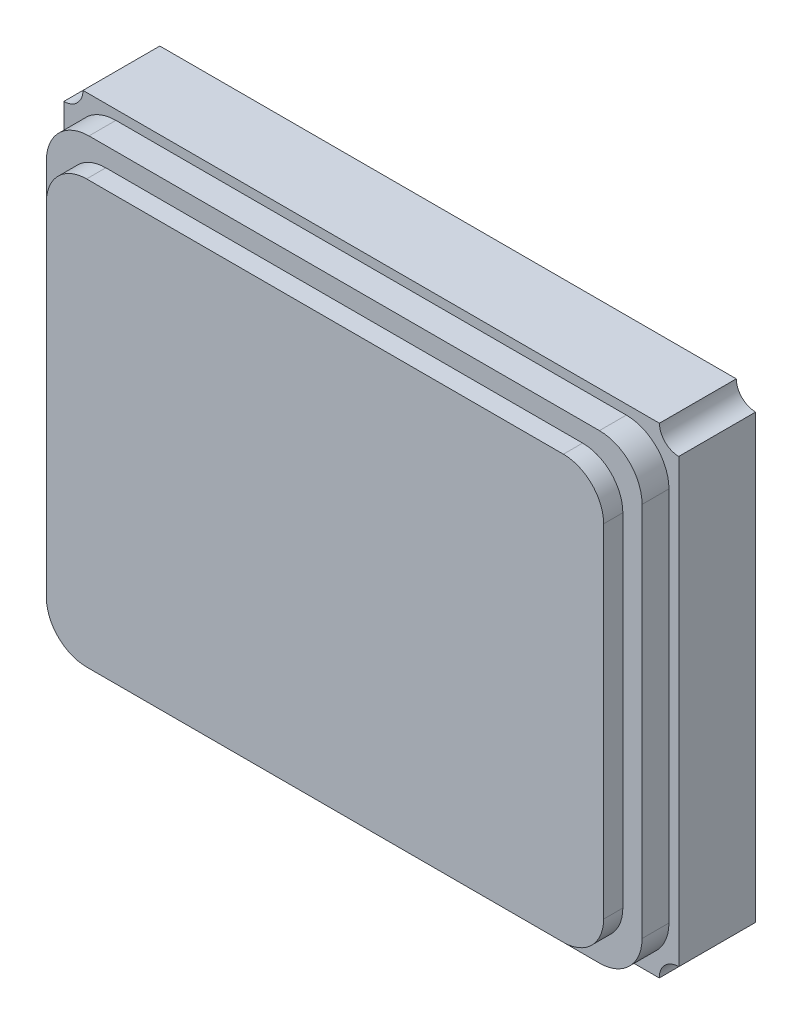
ISO-10303-21;
HEADER;
FILE_DESCRIPTION(('STEP AP214'),'2;1');
FILE_NAME('part.step','',(''),(''),'','','');
FILE_SCHEMA(('AUTOMOTIVE_DESIGN { 1 0 10303 214 1 1 1 1 }'));
ENDSEC;
DATA;
#1=APPLICATION_CONTEXT('core data for automotive mechanical design processes');
#2=APPLICATION_PROTOCOL_DEFINITION('international standard','automotive_design',2000,#1);
#3=PRODUCT_CONTEXT('',#1,'mechanical');
#4=PRODUCT('Part','Part','',(#3));
#5=PRODUCT_RELATED_PRODUCT_CATEGORY('part','',(#4));
#6=PRODUCT_DEFINITION_FORMATION('','',#4);
#7=PRODUCT_DEFINITION_CONTEXT('part definition',#1,'design');
#8=PRODUCT_DEFINITION('design','',#6,#7);
#9=PRODUCT_DEFINITION_SHAPE('','',#8);
#10=(LENGTH_UNIT() NAMED_UNIT(*) SI_UNIT(.MILLI.,.METRE.));
#11=(NAMED_UNIT(*) PLANE_ANGLE_UNIT() SI_UNIT($,.RADIAN.));
#12=(NAMED_UNIT(*) SI_UNIT($,.STERADIAN.) SOLID_ANGLE_UNIT());
#13=UNCERTAINTY_MEASURE_WITH_UNIT(LENGTH_MEASURE(1.E-05),#10,'distance_accuracy_value','');
#14=(GEOMETRIC_REPRESENTATION_CONTEXT(3) GLOBAL_UNCERTAINTY_ASSIGNED_CONTEXT((#13)) GLOBAL_UNIT_ASSIGNED_CONTEXT((#10,
#11,#12)) REPRESENTATION_CONTEXT('',''));
#15=CARTESIAN_POINT('',(0.,0.,0.));
#16=DIRECTION('',(0.,0.,1.));
#17=DIRECTION('',(1.,0.,0.));
#18=AXIS2_PLACEMENT_3D('',#15,#16,#17);
#19=CARTESIAN_POINT('',(0.0008802163144183,-0.0008850774637298,0.));
#20=DIRECTION('',(0.,0.,1.));
#21=DIRECTION('',(1.,0.,0.));
#22=AXIS2_PLACEMENT_3D('',#19,#20,#21);
#23=PLANE('',#22);
#24=DIRECTION('',(1.,0.,0.));
#25=VECTOR('',#24,1.);
#26=CARTESIAN_POINT('',(-1.499580396422,1.249506131818,0.));
#27=LINE('',#26,#25);
#28=CARTESIAN_POINT('',(-1.499580396422,1.249506131818,0.));
#29=VERTEX_POINT('',#28);
#30=CARTESIAN_POINT('',(1.500419603578,1.249506131818,0.));
#31=VERTEX_POINT('',#30);
#32=EDGE_CURVE('E441',#29,#31,#27,.T.);
#33=ORIENTED_EDGE('',*,*,#32,.T.);
#34=CARTESIAN_POINT('',(1.600419603578,1.250214196517,0.));
#35=DIRECTION('',(0.,0.,1.));
#36=DIRECTION('',(1.,0.,0.));
#37=AXIS2_PLACEMENT_3D('',#34,#35,#36);
#38=CIRCLE('',#37,0.100002506747);
#39=CARTESIAN_POINT('',(1.601127668277,1.150214196517,0.));
#40=VERTEX_POINT('',#39);
#41=EDGE_CURVE('E285',#31,#40,#38,.T.);
#42=ORIENTED_EDGE('',*,*,#41,.T.);
#43=DIRECTION('',(0.,-1.,0.));
#44=VECTOR('',#43,1.);
#45=CARTESIAN_POINT('',(1.601127668277,1.150214196517,0.));
#46=LINE('',#45,#44);
#47=CARTESIAN_POINT('',(1.601127668277,-1.149785803483,0.));
#48=VERTEX_POINT('',#47);
#49=EDGE_CURVE('E339',#40,#48,#46,.T.);
#50=ORIENTED_EDGE('',*,*,#49,.T.);
#51=CARTESIAN_POINT('',(1.599580396422,-1.249785803483,0.));
#52=DIRECTION('',(0.,0.,1.));
#53=DIRECTION('',(1.,0.,0.));
#54=AXIS2_PLACEMENT_3D('',#51,#52,#53);
#55=CIRCLE('',#54,0.100011969535);
#56=CARTESIAN_POINT('',(1.499580396422,-1.251333075338,0.));
#57=VERTEX_POINT('',#56);
#58=EDGE_CURVE('E27',#48,#57,#55,.T.);
#59=ORIENTED_EDGE('',*,*,#58,.T.);
#60=DIRECTION('',(-1.,0.,0.));
#61=VECTOR('',#60,1.);
#62=CARTESIAN_POINT('',(1.499580396422,-1.251333075338,0.));
#63=LINE('',#62,#61);
#64=CARTESIAN_POINT('',(-1.500419603578,-1.251333075338,0.));
#65=VERTEX_POINT('',#64);
#66=EDGE_CURVE('E11',#57,#65,#63,.T.);
#67=ORIENTED_EDGE('',*,*,#66,.T.);
#68=CARTESIAN_POINT('',(-1.600419603578,-1.250214196517,0.));
#69=DIRECTION('',(0.,0.,1.));
#70=DIRECTION('',(1.,0.,0.));
#71=AXIS2_PLACEMENT_3D('',#68,#69,#70);
#72=CIRCLE('',#71,0.100006259253);
#73=CARTESIAN_POINT('',(-1.599300724757,-1.150214196517,0.));
#74=VERTEX_POINT('',#73);
#75=EDGE_CURVE('E376',#65,#74,#72,.T.);
#76=ORIENTED_EDGE('',*,*,#75,.T.);
#77=DIRECTION('',(0.,1.,0.));
#78=VECTOR('',#77,1.);
#79=CARTESIAN_POINT('',(-1.599300724757,-1.150214196517,0.));
#80=LINE('',#79,#78);
#81=CARTESIAN_POINT('',(-1.599300724757,1.149785803483,0.));
#82=VERTEX_POINT('',#81);
#83=EDGE_CURVE('E284',#74,#82,#80,.T.);
#84=ORIENTED_EDGE('',*,*,#83,.T.);
#85=CARTESIAN_POINT('',(-1.599580396422,1.249785803483,0.));
#86=DIRECTION('',(0.,0.,1.));
#87=DIRECTION('',(1.,0.,0.));
#88=AXIS2_PLACEMENT_3D('',#85,#86,#87);
#89=CIRCLE('',#88,0.10000039108);
#90=EDGE_CURVE('E354',#82,#29,#89,.T.);
#91=ORIENTED_EDGE('',*,*,#90,.T.);
#92=EDGE_LOOP('',(#33,#42,#50,#59,#67,#76,#84,#91));
#93=FACE_BOUND('',#92,.T.);
#94=ADVANCED_FACE('F16',(#93),#23,.F.);
#95=CARTESIAN_POINT('',(1.499580396422,-1.251333075338,0.));
#96=DIRECTION('',(0.,-1.,0.));
#97=DIRECTION('',(0.,0.,-1.));
#98=AXIS2_PLACEMENT_3D('',#95,#96,#97);
#99=PLANE('',#98);
#100=DIRECTION('',(0.,0.,1.));
#101=VECTOR('',#100,1.);
#102=CARTESIAN_POINT('',(1.499580396422,-1.251333075338,0.));
#103=LINE('',#102,#101);
#104=CARTESIAN_POINT('',(1.499580396422,-1.251333075338,0.4));
#105=VERTEX_POINT('',#104);
#106=EDGE_CURVE('E59',#57,#105,#103,.T.);
#107=ORIENTED_EDGE('',*,*,#106,.T.);
#108=DIRECTION('',(-1.,0.,0.));
#109=VECTOR('',#108,1.);
#110=CARTESIAN_POINT('',(1.499580396422,-1.251333075338,0.4));
#111=LINE('',#110,#109);
#112=CARTESIAN_POINT('',(-1.500419603578,-1.251333075338,0.4));
#113=VERTEX_POINT('',#112);
#114=EDGE_CURVE('E297',#105,#113,#111,.T.);
#115=ORIENTED_EDGE('',*,*,#114,.T.);
#116=DIRECTION('',(0.,0.,1.));
#117=VECTOR('',#116,1.);
#118=CARTESIAN_POINT('',(-1.500419603578,-1.251333075338,0.));
#119=LINE('',#118,#117);
#120=EDGE_CURVE('E75',#65,#113,#119,.T.);
#121=ORIENTED_EDGE('',*,*,#120,.F.);
#122=ORIENTED_EDGE('',*,*,#66,.F.);
#123=EDGE_LOOP('',(#107,#115,#121,#122));
#124=FACE_BOUND('',#123,.T.);
#125=ADVANCED_FACE('F573',(#124),#99,.T.);
#126=CARTESIAN_POINT('',(1.599580396422,-1.249785803483,0.));
#127=DIRECTION('',(0.,0.,-1.));
#128=DIRECTION('',(1.,0.,0.));
#129=AXIS2_PLACEMENT_3D('',#126,#127,#128);
#130=CYLINDRICAL_SURFACE('',#129,0.100011969535);
#131=DIRECTION('',(0.,0.,1.));
#132=VECTOR('',#131,1.);
#133=CARTESIAN_POINT('',(1.601127668277,-1.149785803483,0.));
#134=LINE('',#133,#132);
#135=CARTESIAN_POINT('',(1.601127668277,-1.149785803483,0.4));
#136=VERTEX_POINT('',#135);
#137=EDGE_CURVE('E321',#48,#136,#134,.T.);
#138=ORIENTED_EDGE('',*,*,#137,.T.);
#139=CARTESIAN_POINT('',(1.599580396422,-1.249785803483,0.4));
#140=DIRECTION('',(0.,0.,1.));
#141=DIRECTION('',(1.,0.,0.));
#142=AXIS2_PLACEMENT_3D('',#139,#140,#141);
#143=CIRCLE('',#142,0.100011969535);
#144=EDGE_CURVE('E299',#136,#105,#143,.T.);
#145=ORIENTED_EDGE('',*,*,#144,.T.);
#146=ORIENTED_EDGE('',*,*,#106,.F.);
#147=ORIENTED_EDGE('',*,*,#58,.F.);
#148=EDGE_LOOP('',(#138,#145,#146,#147));
#149=FACE_BOUND('',#148,.T.);
#150=ADVANCED_FACE('F575',(#149),#130,.F.);
#151=CARTESIAN_POINT('',(-1.600419603578,-1.250214196517,0.));
#152=DIRECTION('',(0.,0.,-1.));
#153=DIRECTION('',(1.,0.,0.));
#154=AXIS2_PLACEMENT_3D('',#151,#152,#153);
#155=CYLINDRICAL_SURFACE('',#154,0.100006259253);
#156=ORIENTED_EDGE('',*,*,#120,.T.);
#157=CARTESIAN_POINT('',(-1.600419603578,-1.250214196517,0.4));
#158=DIRECTION('',(0.,0.,1.));
#159=DIRECTION('',(1.,0.,0.));
#160=AXIS2_PLACEMENT_3D('',#157,#158,#159);
#161=CIRCLE('',#160,0.100006259253);
#162=CARTESIAN_POINT('',(-1.599300724757,-1.150214196517,0.4));
#163=VERTEX_POINT('',#162);
#164=EDGE_CURVE('E300',#113,#163,#161,.T.);
#165=ORIENTED_EDGE('',*,*,#164,.T.);
#166=DIRECTION('',(0.,0.,1.));
#167=VECTOR('',#166,1.);
#168=CARTESIAN_POINT('',(-1.599300724757,-1.150214196517,0.));
#169=LINE('',#168,#167);
#170=EDGE_CURVE('E281',#74,#163,#169,.T.);
#171=ORIENTED_EDGE('',*,*,#170,.F.);
#172=ORIENTED_EDGE('',*,*,#75,.F.);
#173=EDGE_LOOP('',(#156,#165,#171,#172));
#174=FACE_BOUND('',#173,.T.);
#175=ADVANCED_FACE('F572',(#174),#155,.F.);
#176=CARTESIAN_POINT('',(1.601127668277,1.150214196517,0.));
#177=DIRECTION('',(1.,0.,0.));
#178=DIRECTION('',(0.,1.,0.));
#179=AXIS2_PLACEMENT_3D('',#176,#177,#178);
#180=PLANE('',#179);
#181=DIRECTION('',(0.,0.,1.));
#182=VECTOR('',#181,1.);
#183=CARTESIAN_POINT('',(1.601127668277,1.150214196517,0.));
#184=LINE('',#183,#182);
#185=CARTESIAN_POINT('',(1.601127668277,1.150214196517,0.4));
#186=VERTEX_POINT('',#185);
#187=EDGE_CURVE('E358',#40,#186,#184,.T.);
#188=ORIENTED_EDGE('',*,*,#187,.T.);
#189=DIRECTION('',(0.,-1.,0.));
#190=VECTOR('',#189,1.);
#191=CARTESIAN_POINT('',(1.601127668277,1.150214196517,0.4));
#192=LINE('',#191,#190);
#193=EDGE_CURVE('E414',#186,#136,#192,.T.);
#194=ORIENTED_EDGE('',*,*,#193,.T.);
#195=ORIENTED_EDGE('',*,*,#137,.F.);
#196=ORIENTED_EDGE('',*,*,#49,.F.);
#197=EDGE_LOOP('',(#188,#194,#195,#196));
#198=FACE_BOUND('',#197,.T.);
#199=ADVANCED_FACE('F624',(#198),#180,.T.);
#200=CARTESIAN_POINT('',(-1.599300724757,-1.150214196517,0.));
#201=DIRECTION('',(-1.,0.,0.));
#202=DIRECTION('',(0.,0.,1.));
#203=AXIS2_PLACEMENT_3D('',#200,#201,#202);
#204=PLANE('',#203);
#205=ORIENTED_EDGE('',*,*,#170,.T.);
#206=DIRECTION('',(0.,1.,0.));
#207=VECTOR('',#206,1.);
#208=CARTESIAN_POINT('',(-1.599300724757,-1.150214196517,0.4));
#209=LINE('',#208,#207);
#210=CARTESIAN_POINT('',(-1.599300724757,1.149785803483,0.4));
#211=VERTEX_POINT('',#210);
#212=EDGE_CURVE('E322',#163,#211,#209,.T.);
#213=ORIENTED_EDGE('',*,*,#212,.T.);
#214=DIRECTION('',(0.,0.,1.));
#215=VECTOR('',#214,1.);
#216=CARTESIAN_POINT('',(-1.599300724757,1.149785803483,0.));
#217=LINE('',#216,#215);
#218=EDGE_CURVE('E359',#82,#211,#217,.T.);
#219=ORIENTED_EDGE('',*,*,#218,.F.);
#220=ORIENTED_EDGE('',*,*,#83,.F.);
#221=EDGE_LOOP('',(#205,#213,#219,#220));
#222=FACE_BOUND('',#221,.T.);
#223=ADVANCED_FACE('F567',(#222),#204,.T.);
#224=CARTESIAN_POINT('',(1.600419603578,1.250214196517,0.));
#225=DIRECTION('',(0.,0.,-1.));
#226=DIRECTION('',(1.,0.,0.));
#227=AXIS2_PLACEMENT_3D('',#224,#225,#226);
#228=CYLINDRICAL_SURFACE('',#227,0.100002506747);
#229=DIRECTION('',(0.,0.,1.));
#230=VECTOR('',#229,1.);
#231=CARTESIAN_POINT('',(1.500419603578,1.249506131818,0.));
#232=LINE('',#231,#230);
#233=CARTESIAN_POINT('',(1.500419603578,1.249506131818,0.4));
#234=VERTEX_POINT('',#233);
#235=EDGE_CURVE('E432',#31,#234,#232,.T.);
#236=ORIENTED_EDGE('',*,*,#235,.T.);
#237=CARTESIAN_POINT('',(1.600419603578,1.250214196517,0.4));
#238=DIRECTION('',(0.,0.,1.));
#239=DIRECTION('',(1.,0.,0.));
#240=AXIS2_PLACEMENT_3D('',#237,#238,#239);
#241=CIRCLE('',#240,0.100002506747);
#242=EDGE_CURVE('E418',#234,#186,#241,.T.);
#243=ORIENTED_EDGE('',*,*,#242,.T.);
#244=ORIENTED_EDGE('',*,*,#187,.F.);
#245=ORIENTED_EDGE('',*,*,#41,.F.);
#246=EDGE_LOOP('',(#236,#243,#244,#245));
#247=FACE_BOUND('',#246,.T.);
#248=ADVANCED_FACE('F592',(#247),#228,.F.);
#249=CARTESIAN_POINT('',(-1.599580396422,1.249785803483,0.));
#250=DIRECTION('',(0.,0.,-1.));
#251=DIRECTION('',(1.,0.,0.));
#252=AXIS2_PLACEMENT_3D('',#249,#250,#251);
#253=CYLINDRICAL_SURFACE('',#252,0.10000039108);
#254=ORIENTED_EDGE('',*,*,#218,.T.);
#255=CARTESIAN_POINT('',(-1.599580396422,1.249785803483,0.4));
#256=DIRECTION('',(0.,0.,1.));
#257=DIRECTION('',(1.,0.,0.));
#258=AXIS2_PLACEMENT_3D('',#255,#256,#257);
#259=CIRCLE('',#258,0.10000039108);
#260=CARTESIAN_POINT('',(-1.499580396422,1.249506131818,0.4));
#261=VERTEX_POINT('',#260);
#262=EDGE_CURVE('E326',#211,#261,#259,.T.);
#263=ORIENTED_EDGE('',*,*,#262,.T.);
#264=DIRECTION('',(0.,0.,1.));
#265=VECTOR('',#264,1.);
#266=CARTESIAN_POINT('',(-1.499580396422,1.249506131818,0.));
#267=LINE('',#266,#265);
#268=EDGE_CURVE('E421',#29,#261,#267,.T.);
#269=ORIENTED_EDGE('',*,*,#268,.F.);
#270=ORIENTED_EDGE('',*,*,#90,.F.);
#271=EDGE_LOOP('',(#254,#263,#269,#270));
#272=FACE_BOUND('',#271,.T.);
#273=ADVANCED_FACE('F565',(#272),#253,.F.);
#274=CARTESIAN_POINT('',(-1.499580396422,1.249506131818,0.));
#275=DIRECTION('',(0.,1.,0.));
#276=DIRECTION('',(1.,0.,0.));
#277=AXIS2_PLACEMENT_3D('',#274,#275,#276);
#278=PLANE('',#277);
#279=ORIENTED_EDGE('',*,*,#268,.T.);
#280=DIRECTION('',(1.,0.,0.));
#281=VECTOR('',#280,1.);
#282=CARTESIAN_POINT('',(-1.499580396422,1.249506131818,0.4));
#283=LINE('',#282,#281);
#284=EDGE_CURVE('E316',#261,#234,#283,.T.);
#285=ORIENTED_EDGE('',*,*,#284,.T.);
#286=ORIENTED_EDGE('',*,*,#235,.F.);
#287=ORIENTED_EDGE('',*,*,#32,.F.);
#288=EDGE_LOOP('',(#279,#285,#286,#287));
#289=FACE_BOUND('',#288,.T.);
#290=ADVANCED_FACE('F536',(#289),#278,.T.);
#291=CARTESIAN_POINT('',(0.0008802163144183,-0.0008850774637298,0.4));
#292=DIRECTION('',(0.,0.,1.));
#293=DIRECTION('',(1.,0.,0.));
#294=AXIS2_PLACEMENT_3D('',#291,#292,#293);
#295=PLANE('',#294);
#296=CARTESIAN_POINT('',(1.328205850256,-0.978205850256,0.4));
#297=DIRECTION('',(0.,0.,-1.));
#298=DIRECTION('',(1.,0.,0.));
#299=AXIS2_PLACEMENT_3D('',#296,#297,#298);
#300=CIRCLE('',#299,0.221794149744);
#301=CARTESIAN_POINT('',(1.55,-0.978205850256,0.4));
#302=VERTEX_POINT('',#301);
#303=CARTESIAN_POINT('',(1.328205850256,-1.2,0.4));
#304=VERTEX_POINT('',#303);
#305=EDGE_CURVE('E408',#302,#304,#300,.T.);
#306=ORIENTED_EDGE('',*,*,#305,.T.);
#307=DIRECTION('',(-1.,0.,0.));
#308=VECTOR('',#307,1.);
#309=CARTESIAN_POINT('',(-0.663662816971,-1.2,0.4));
#310=LINE('',#309,#308);
#311=CARTESIAN_POINT('',(-1.328205850256,-1.2,0.4));
#312=VERTEX_POINT('',#311);
#313=EDGE_CURVE('E397',#304,#312,#310,.T.);
#314=ORIENTED_EDGE('',*,*,#313,.T.);
#315=CARTESIAN_POINT('',(-1.328205850256,-0.978205850256,0.4));
#316=DIRECTION('',(0.,0.,-1.));
#317=DIRECTION('',(1.,0.,0.));
#318=AXIS2_PLACEMENT_3D('',#315,#316,#317);
#319=CIRCLE('',#318,0.221794149744);
#320=CARTESIAN_POINT('',(-1.55,-0.978205850256,0.4));
#321=VERTEX_POINT('',#320);
#322=EDGE_CURVE('E309',#312,#321,#319,.T.);
#323=ORIENTED_EDGE('',*,*,#322,.T.);
#324=DIRECTION('',(0.,1.,0.));
#325=VECTOR('',#324,1.);
#326=CARTESIAN_POINT('',(-1.55,0.488660386396,0.4));
#327=LINE('',#326,#325);
#328=CARTESIAN_POINT('',(-1.55,0.978205850256,0.4));
#329=VERTEX_POINT('',#328);
#330=EDGE_CURVE('E155',#321,#329,#327,.T.);
#331=ORIENTED_EDGE('',*,*,#330,.T.);
#332=CARTESIAN_POINT('',(-1.328205850256,0.978205850256,0.4));
#333=DIRECTION('',(0.,0.,-1.));
#334=DIRECTION('',(1.,0.,0.));
#335=AXIS2_PLACEMENT_3D('',#332,#333,#334);
#336=CIRCLE('',#335,0.221794149744);
#337=CARTESIAN_POINT('',(-1.328205850256,1.2,0.4));
#338=VERTEX_POINT('',#337);
#339=EDGE_CURVE('E132',#329,#338,#336,.T.);
#340=ORIENTED_EDGE('',*,*,#339,.T.);
#341=DIRECTION('',(1.,0.,0.));
#342=VECTOR('',#341,1.);
#343=CARTESIAN_POINT('',(0.664543033285,1.2,0.4));
#344=LINE('',#343,#342);
#345=CARTESIAN_POINT('',(1.328205850256,1.2,0.4));
#346=VERTEX_POINT('',#345);
#347=EDGE_CURVE('E274',#338,#346,#344,.T.);
#348=ORIENTED_EDGE('',*,*,#347,.T.);
#349=CARTESIAN_POINT('',(1.328205850256,0.978205850256,0.4));
#350=DIRECTION('',(0.,0.,-1.));
#351=DIRECTION('',(1.,0.,0.));
#352=AXIS2_PLACEMENT_3D('',#349,#350,#351);
#353=CIRCLE('',#352,0.221794149744);
#354=CARTESIAN_POINT('',(1.55,0.978205850256,0.4));
#355=VERTEX_POINT('',#354);
#356=EDGE_CURVE('E272',#346,#355,#353,.T.);
#357=ORIENTED_EDGE('',*,*,#356,.T.);
#358=DIRECTION('',(0.,-1.,0.));
#359=VECTOR('',#358,1.);
#360=CARTESIAN_POINT('',(1.55,-0.48954546386,0.4));
#361=LINE('',#360,#359);
#362=EDGE_CURVE('E144',#355,#302,#361,.T.);
#363=ORIENTED_EDGE('',*,*,#362,.T.);
#364=EDGE_LOOP('',(#306,#314,#323,#331,#340,#348,#357,#363));
#365=FACE_BOUND('',#364,.T.);
#366=ORIENTED_EDGE('',*,*,#284,.F.);
#367=ORIENTED_EDGE('',*,*,#262,.F.);
#368=ORIENTED_EDGE('',*,*,#212,.F.);
#369=ORIENTED_EDGE('',*,*,#164,.F.);
#370=ORIENTED_EDGE('',*,*,#114,.F.);
#371=ORIENTED_EDGE('',*,*,#144,.F.);
#372=ORIENTED_EDGE('',*,*,#193,.F.);
#373=ORIENTED_EDGE('',*,*,#242,.F.);
#374=EDGE_LOOP('',(#366,#367,#368,#369,#370,#371,#372,#373));
#375=FACE_BOUND('',#374,.T.);
#376=ADVANCED_FACE('F532',(#365,#375),#295,.T.);
#377=CARTESIAN_POINT('',(1.328205850256,1.2,0.39));
#378=DIRECTION('',(0.,-1.,0.));
#379=DIRECTION('',(0.,0.,-1.));
#380=AXIS2_PLACEMENT_3D('',#377,#378,#379);
#381=PLANE('',#380);
#382=DIRECTION('',(0.,0.,1.));
#383=VECTOR('',#382,1.);
#384=CARTESIAN_POINT('',(-1.328205850256,1.2,0.39));
#385=LINE('',#384,#383);
#386=CARTESIAN_POINT('',(-1.328205850256,1.2,0.54));
#387=VERTEX_POINT('',#386);
#388=EDGE_CURVE('E399',#338,#387,#385,.T.);
#389=ORIENTED_EDGE('',*,*,#388,.T.);
#390=DIRECTION('',(-1.,0.,0.));
#391=VECTOR('',#390,1.);
#392=CARTESIAN_POINT('',(1.328205850256,1.2,0.54));
#393=LINE('',#392,#391);
#394=CARTESIAN_POINT('',(1.328205850256,1.2,0.54));
#395=VERTEX_POINT('',#394);
#396=EDGE_CURVE('E308',#395,#387,#393,.T.);
#397=ORIENTED_EDGE('',*,*,#396,.F.);
#398=DIRECTION('',(0.,0.,1.));
#399=VECTOR('',#398,1.);
#400=CARTESIAN_POINT('',(1.328205850256,1.2,0.39));
#401=LINE('',#400,#399);
#402=EDGE_CURVE('E275',#346,#395,#401,.T.);
#403=ORIENTED_EDGE('',*,*,#402,.F.);
#404=ORIENTED_EDGE('',*,*,#347,.F.);
#405=EDGE_LOOP('',(#389,#397,#403,#404));
#406=FACE_BOUND('',#405,.T.);
#407=ADVANCED_FACE('F535',(#406),#381,.F.);
#408=CARTESIAN_POINT('',(1.328205850256,0.978205850256,0.39));
#409=DIRECTION('',(0.,0.,-1.));
#410=DIRECTION('',(1.,0.,0.));
#411=AXIS2_PLACEMENT_3D('',#408,#409,#410);
#412=CYLINDRICAL_SURFACE('',#411,0.221794149744);
#413=ORIENTED_EDGE('',*,*,#402,.T.);
#414=CARTESIAN_POINT('',(1.328205850256,0.978205850256,0.54));
#415=DIRECTION('',(0.,0.,1.));
#416=DIRECTION('',(1.,0.,0.));
#417=AXIS2_PLACEMENT_3D('',#414,#415,#416);
#418=CIRCLE('',#417,0.221794149744);
#419=CARTESIAN_POINT('',(1.55,0.978205850256,0.54));
#420=VERTEX_POINT('',#419);
#421=EDGE_CURVE('E334',#420,#395,#418,.T.);
#422=ORIENTED_EDGE('',*,*,#421,.F.);
#423=DIRECTION('',(0.,0.,1.));
#424=VECTOR('',#423,1.);
#425=CARTESIAN_POINT('',(1.55,0.978205850256,0.39));
#426=LINE('',#425,#424);
#427=EDGE_CURVE('E292',#355,#420,#426,.T.);
#428=ORIENTED_EDGE('',*,*,#427,.F.);
#429=ORIENTED_EDGE('',*,*,#356,.F.);
#430=EDGE_LOOP('',(#413,#422,#428,#429));
#431=FACE_BOUND('',#430,.T.);
#432=ADVANCED_FACE('F597',(#431),#412,.T.);
#433=CARTESIAN_POINT('',(-1.328205850256,0.978205850256,0.39));
#434=DIRECTION('',(0.,0.,-1.));
#435=DIRECTION('',(1.,0.,0.));
#436=AXIS2_PLACEMENT_3D('',#433,#434,#435);
#437=CYLINDRICAL_SURFACE('',#436,0.221794149744);
#438=DIRECTION('',(0.,0.,1.));
#439=VECTOR('',#438,1.);
#440=CARTESIAN_POINT('',(-1.55,0.978205850256,0.39));
#441=LINE('',#440,#439);
#442=CARTESIAN_POINT('',(-1.55,0.978205850256,0.54));
#443=VERTEX_POINT('',#442);
#444=EDGE_CURVE('E293',#329,#443,#441,.T.);
#445=ORIENTED_EDGE('',*,*,#444,.T.);
#446=CARTESIAN_POINT('',(-1.328205850256,0.978205850256,0.54));
#447=DIRECTION('',(0.,0.,1.));
#448=DIRECTION('',(1.,0.,0.));
#449=AXIS2_PLACEMENT_3D('',#446,#447,#448);
#450=CIRCLE('',#449,0.221794149744);
#451=EDGE_CURVE('E304',#387,#443,#450,.T.);
#452=ORIENTED_EDGE('',*,*,#451,.F.);
#453=ORIENTED_EDGE('',*,*,#388,.F.);
#454=ORIENTED_EDGE('',*,*,#339,.F.);
#455=EDGE_LOOP('',(#445,#452,#453,#454));
#456=FACE_BOUND('',#455,.T.);
#457=ADVANCED_FACE('F614',(#456),#437,.T.);
#458=CARTESIAN_POINT('',(1.55,-0.978205850256,0.39));
#459=DIRECTION('',(-1.,0.,0.));
#460=DIRECTION('',(0.,0.,1.));
#461=AXIS2_PLACEMENT_3D('',#458,#459,#460);
#462=PLANE('',#461);
#463=ORIENTED_EDGE('',*,*,#427,.T.);
#464=DIRECTION('',(0.,1.,0.));
#465=VECTOR('',#464,1.);
#466=CARTESIAN_POINT('',(1.55,-0.978205850256,0.54));
#467=LINE('',#466,#465);
#468=CARTESIAN_POINT('',(1.55,-0.978205850256,0.54));
#469=VERTEX_POINT('',#468);
#470=EDGE_CURVE('E330',#469,#420,#467,.T.);
#471=ORIENTED_EDGE('',*,*,#470,.F.);
#472=DIRECTION('',(0.,0.,1.));
#473=VECTOR('',#472,1.);
#474=CARTESIAN_POINT('',(1.55,-0.978205850256,0.39));
#475=LINE('',#474,#473);
#476=EDGE_CURVE('E312',#302,#469,#475,.T.);
#477=ORIENTED_EDGE('',*,*,#476,.F.);
#478=ORIENTED_EDGE('',*,*,#362,.F.);
#479=EDGE_LOOP('',(#463,#471,#477,#478));
#480=FACE_BOUND('',#479,.T.);
#481=ADVANCED_FACE('F503',(#480),#462,.F.);
#482=CARTESIAN_POINT('',(-1.55,0.978205850256,0.39));
#483=DIRECTION('',(1.,0.,0.));
#484=DIRECTION('',(0.,1.,0.));
#485=AXIS2_PLACEMENT_3D('',#482,#483,#484);
#486=PLANE('',#485);
#487=DIRECTION('',(0.,0.,1.));
#488=VECTOR('',#487,1.);
#489=CARTESIAN_POINT('',(-1.55,-0.978205850256,0.39));
#490=LINE('',#489,#488);
#491=CARTESIAN_POINT('',(-1.55,-0.978205850256,0.54));
#492=VERTEX_POINT('',#491);
#493=EDGE_CURVE('E313',#321,#492,#490,.T.);
#494=ORIENTED_EDGE('',*,*,#493,.T.);
#495=DIRECTION('',(0.,-1.,0.));
#496=VECTOR('',#495,1.);
#497=CARTESIAN_POINT('',(-1.55,0.978205850256,0.54));
#498=LINE('',#497,#496);
#499=EDGE_CURVE('E20',#443,#492,#498,.T.);
#500=ORIENTED_EDGE('',*,*,#499,.F.);
#501=ORIENTED_EDGE('',*,*,#444,.F.);
#502=ORIENTED_EDGE('',*,*,#330,.F.);
#503=EDGE_LOOP('',(#494,#500,#501,#502));
#504=FACE_BOUND('',#503,.T.);
#505=ADVANCED_FACE('F591',(#504),#486,.F.);
#506=CARTESIAN_POINT('',(1.328205850256,-0.978205850256,0.39));
#507=DIRECTION('',(0.,0.,-1.));
#508=DIRECTION('',(1.,0.,0.));
#509=AXIS2_PLACEMENT_3D('',#506,#507,#508);
#510=CYLINDRICAL_SURFACE('',#509,0.221794149744);
#511=ORIENTED_EDGE('',*,*,#476,.T.);
#512=CARTESIAN_POINT('',(1.328205850256,-0.978205850256,0.54));
#513=DIRECTION('',(0.,0.,1.));
#514=DIRECTION('',(1.,0.,0.));
#515=AXIS2_PLACEMENT_3D('',#512,#513,#514);
#516=CIRCLE('',#515,0.221794149744);
#517=CARTESIAN_POINT('',(1.328205850256,-1.2,0.54));
#518=VERTEX_POINT('',#517);
#519=EDGE_CURVE('E335',#518,#469,#516,.T.);
#520=ORIENTED_EDGE('',*,*,#519,.F.);
#521=DIRECTION('',(0.,0.,1.));
#522=VECTOR('',#521,1.);
#523=CARTESIAN_POINT('',(1.328205850256,-1.2,0.39));
#524=LINE('',#523,#522);
#525=EDGE_CURVE('E367',#304,#518,#524,.T.);
#526=ORIENTED_EDGE('',*,*,#525,.F.);
#527=ORIENTED_EDGE('',*,*,#305,.F.);
#528=EDGE_LOOP('',(#511,#520,#526,#527));
#529=FACE_BOUND('',#528,.T.);
#530=ADVANCED_FACE('F500',(#529),#510,.T.);
#531=CARTESIAN_POINT('',(-1.328205850256,-0.978205850256,0.39));
#532=DIRECTION('',(0.,0.,-1.));
#533=DIRECTION('',(1.,0.,0.));
#534=AXIS2_PLACEMENT_3D('',#531,#532,#533);
#535=CYLINDRICAL_SURFACE('',#534,0.221794149744);
#536=DIRECTION('',(0.,0.,1.));
#537=VECTOR('',#536,1.);
#538=CARTESIAN_POINT('',(-1.328205850256,-1.2,0.39));
#539=LINE('',#538,#537);
#540=CARTESIAN_POINT('',(-1.328205850256,-1.2,0.54));
#541=VERTEX_POINT('',#540);
#542=EDGE_CURVE('E392',#312,#541,#539,.T.);
#543=ORIENTED_EDGE('',*,*,#542,.T.);
#544=CARTESIAN_POINT('',(-1.328205850256,-0.978205850256,0.54));
#545=DIRECTION('',(0.,0.,1.));
#546=DIRECTION('',(1.,0.,0.));
#547=AXIS2_PLACEMENT_3D('',#544,#545,#546);
#548=CIRCLE('',#547,0.221794149744);
#549=EDGE_CURVE('E363',#492,#541,#548,.T.);
#550=ORIENTED_EDGE('',*,*,#549,.F.);
#551=ORIENTED_EDGE('',*,*,#493,.F.);
#552=ORIENTED_EDGE('',*,*,#322,.F.);
#553=EDGE_LOOP('',(#543,#550,#551,#552));
#554=FACE_BOUND('',#553,.T.);
#555=ADVANCED_FACE('F590',(#554),#535,.T.);
#556=CARTESIAN_POINT('',(-1.328205850256,-1.2,0.39));
#557=DIRECTION('',(0.,1.,0.));
#558=DIRECTION('',(1.,0.,0.));
#559=AXIS2_PLACEMENT_3D('',#556,#557,#558);
#560=PLANE('',#559);
#561=ORIENTED_EDGE('',*,*,#525,.T.);
#562=DIRECTION('',(1.,0.,0.));
#563=VECTOR('',#562,1.);
#564=CARTESIAN_POINT('',(-1.328205850256,-1.2,0.54));
#565=LINE('',#564,#563);
#566=EDGE_CURVE('E381',#541,#518,#565,.T.);
#567=ORIENTED_EDGE('',*,*,#566,.F.);
#568=ORIENTED_EDGE('',*,*,#542,.F.);
#569=ORIENTED_EDGE('',*,*,#313,.F.);
#570=EDGE_LOOP('',(#561,#567,#568,#569));
#571=FACE_BOUND('',#570,.T.);
#572=ADVANCED_FACE('F512',(#571),#560,.F.);
#573=CARTESIAN_POINT('',(0.,0.,0.54));
#574=DIRECTION('',(0.,0.,1.));
#575=DIRECTION('',(1.,0.,0.));
#576=AXIS2_PLACEMENT_3D('',#573,#574,#575);
#577=PLANE('',#576);
#578=DIRECTION('',(1.,0.,0.));
#579=VECTOR('',#578,1.);
#580=CARTESIAN_POINT('',(-1.240692780974,-1.1,0.54));
#581=LINE('',#580,#579);
#582=CARTESIAN_POINT('',(-1.240692780974,-1.1,0.54));
#583=VERTEX_POINT('',#582);
#584=CARTESIAN_POINT('',(1.240692780974,-1.1,0.54));
#585=VERTEX_POINT('',#584);
#586=EDGE_CURVE('E345',#583,#585,#581,.T.);
#587=ORIENTED_EDGE('',*,*,#586,.F.);
#588=CARTESIAN_POINT('',(-1.240692780974,-0.890692780974,0.54));
#589=DIRECTION('',(0.,0.,1.));
#590=DIRECTION('',(1.,0.,0.));
#591=AXIS2_PLACEMENT_3D('',#588,#589,#590);
#592=CIRCLE('',#591,0.209307219026);
#593=CARTESIAN_POINT('',(-1.45,-0.890692780974,0.54));
#594=VERTEX_POINT('',#593);
#595=EDGE_CURVE('E329',#594,#583,#592,.T.);
#596=ORIENTED_EDGE('',*,*,#595,.F.);
#597=DIRECTION('',(0.,-1.,0.));
#598=VECTOR('',#597,1.);
#599=CARTESIAN_POINT('',(-1.45,0.890692780974,0.54));
#600=LINE('',#599,#598);
#601=CARTESIAN_POINT('',(-1.45,0.890692780974,0.54));
#602=VERTEX_POINT('',#601);
#603=EDGE_CURVE('E296',#602,#594,#600,.T.);
#604=ORIENTED_EDGE('',*,*,#603,.F.);
#605=CARTESIAN_POINT('',(-1.240692780974,0.890692780974,0.54));
#606=DIRECTION('',(0.,0.,1.));
#607=DIRECTION('',(1.,0.,0.));
#608=AXIS2_PLACEMENT_3D('',#605,#606,#607);
#609=CIRCLE('',#608,0.209307219026);
#610=CARTESIAN_POINT('',(-1.240692780974,1.1,0.54));
#611=VERTEX_POINT('',#610);
#612=EDGE_CURVE('E279',#611,#602,#609,.T.);
#613=ORIENTED_EDGE('',*,*,#612,.F.);
#614=DIRECTION('',(-1.,0.,0.));
#615=VECTOR('',#614,1.);
#616=CARTESIAN_POINT('',(1.240692780974,1.1,0.54));
#617=LINE('',#616,#615);
#618=CARTESIAN_POINT('',(1.240692780974,1.1,0.54));
#619=VERTEX_POINT('',#618);
#620=EDGE_CURVE('E280',#619,#611,#617,.T.);
#621=ORIENTED_EDGE('',*,*,#620,.F.);
#622=CARTESIAN_POINT('',(1.240692780974,0.890692780974,0.54));
#623=DIRECTION('',(0.,0.,1.));
#624=DIRECTION('',(1.,0.,0.));
#625=AXIS2_PLACEMENT_3D('',#622,#623,#624);
#626=CIRCLE('',#625,0.209307219026);
#627=CARTESIAN_POINT('',(1.45,0.890692780974,0.54));
#628=VERTEX_POINT('',#627);
#629=EDGE_CURVE('E241',#628,#619,#626,.T.);
#630=ORIENTED_EDGE('',*,*,#629,.F.);
#631=DIRECTION('',(0.,1.,0.));
#632=VECTOR('',#631,1.);
#633=CARTESIAN_POINT('',(1.45,-0.890692780974,0.54));
#634=LINE('',#633,#632);
#635=CARTESIAN_POINT('',(1.45,-0.890692780974,0.54));
#636=VERTEX_POINT('',#635);
#637=EDGE_CURVE('E232',#636,#628,#634,.T.);
#638=ORIENTED_EDGE('',*,*,#637,.F.);
#639=CARTESIAN_POINT('',(1.240692780974,-0.890692780974,0.54));
#640=DIRECTION('',(0.,0.,1.));
#641=DIRECTION('',(1.,0.,0.));
#642=AXIS2_PLACEMENT_3D('',#639,#640,#641);
#643=CIRCLE('',#642,0.209307219026);
#644=EDGE_CURVE('E238',#585,#636,#643,.T.);
#645=ORIENTED_EDGE('',*,*,#644,.F.);
#646=EDGE_LOOP('',(#587,#596,#604,#613,#621,#630,#638,#645));
#647=FACE_BOUND('',#646,.T.);
#648=ORIENTED_EDGE('',*,*,#566,.T.);
#649=ORIENTED_EDGE('',*,*,#519,.T.);
#650=ORIENTED_EDGE('',*,*,#470,.T.);
#651=ORIENTED_EDGE('',*,*,#421,.T.);
#652=ORIENTED_EDGE('',*,*,#396,.T.);
#653=ORIENTED_EDGE('',*,*,#451,.T.);
#654=ORIENTED_EDGE('',*,*,#499,.T.);
#655=ORIENTED_EDGE('',*,*,#549,.T.);
#656=EDGE_LOOP('',(#648,#649,#650,#651,#652,#653,#654,#655));
#657=FACE_BOUND('',#656,.T.);
#658=ADVANCED_FACE('F235',(#647,#657),#577,.T.);
#659=CARTESIAN_POINT('',(-1.240692780974,-0.890692780974,0.54));
#660=DIRECTION('',(0.,0.,-1.));
#661=DIRECTION('',(1.,0.,0.));
#662=AXIS2_PLACEMENT_3D('',#659,#660,#661);
#663=CYLINDRICAL_SURFACE('',#662,0.209307219026);
#664=ORIENTED_EDGE('',*,*,#595,.T.);
#665=DIRECTION('',(0.,0.,1.));
#666=VECTOR('',#665,1.);
#667=CARTESIAN_POINT('',(-1.240692780974,-1.1,0.54));
#668=LINE('',#667,#666);
#669=CARTESIAN_POINT('',(-1.240692780974,-1.1,0.64));
#670=VERTEX_POINT('',#669);
#671=EDGE_CURVE('E261',#583,#670,#668,.T.);
#672=ORIENTED_EDGE('',*,*,#671,.T.);
#673=CARTESIAN_POINT('',(-1.240692780974,-0.890692780974,0.64));
#674=DIRECTION('',(0.,0.,1.));
#675=DIRECTION('',(1.,0.,0.));
#676=AXIS2_PLACEMENT_3D('',#673,#674,#675);
#677=CIRCLE('',#676,0.209307219026);
#678=CARTESIAN_POINT('',(-1.45,-0.890692780974,0.64));
#679=VERTEX_POINT('',#678);
#680=EDGE_CURVE('E341',#679,#670,#677,.T.);
#681=ORIENTED_EDGE('',*,*,#680,.F.);
#682=DIRECTION('',(0.,0.,1.));
#683=VECTOR('',#682,1.);
#684=CARTESIAN_POINT('',(-1.45,-0.890692780974,0.54));
#685=LINE('',#684,#683);
#686=EDGE_CURVE('E206',#594,#679,#685,.T.);
#687=ORIENTED_EDGE('',*,*,#686,.F.);
#688=EDGE_LOOP('',(#664,#672,#681,#687));
#689=FACE_BOUND('',#688,.T.);
#690=ADVANCED_FACE('F481',(#689),#663,.T.);
#691=CARTESIAN_POINT('',(-1.45,0.890692780974,0.54));
#692=DIRECTION('',(1.,0.,0.));
#693=DIRECTION('',(0.,1.,0.));
#694=AXIS2_PLACEMENT_3D('',#691,#692,#693);
#695=PLANE('',#694);
#696=ORIENTED_EDGE('',*,*,#603,.T.);
#697=ORIENTED_EDGE('',*,*,#686,.T.);
#698=DIRECTION('',(0.,-1.,0.));
#699=VECTOR('',#698,1.);
#700=CARTESIAN_POINT('',(-1.45,0.890692780974,0.64));
#701=LINE('',#700,#699);
#702=CARTESIAN_POINT('',(-1.45,0.890692780974,0.64));
#703=VERTEX_POINT('',#702);
#704=EDGE_CURVE('E346',#703,#679,#701,.T.);
#705=ORIENTED_EDGE('',*,*,#704,.F.);
#706=DIRECTION('',(0.,0.,1.));
#707=VECTOR('',#706,1.);
#708=CARTESIAN_POINT('',(-1.45,0.890692780974,0.54));
#709=LINE('',#708,#707);
#710=EDGE_CURVE('E218',#602,#703,#709,.T.);
#711=ORIENTED_EDGE('',*,*,#710,.F.);
#712=EDGE_LOOP('',(#696,#697,#705,#711));
#713=FACE_BOUND('',#712,.T.);
#714=ADVANCED_FACE('F601',(#713),#695,.F.);
#715=CARTESIAN_POINT('',(-1.240692780974,0.890692780974,0.54));
#716=DIRECTION('',(0.,0.,-1.));
#717=DIRECTION('',(1.,0.,0.));
#718=AXIS2_PLACEMENT_3D('',#715,#716,#717);
#719=CYLINDRICAL_SURFACE('',#718,0.209307219026);
#720=ORIENTED_EDGE('',*,*,#612,.T.);
#721=ORIENTED_EDGE('',*,*,#710,.T.);
#722=CARTESIAN_POINT('',(-1.240692780974,0.890692780974,0.64));
#723=DIRECTION('',(0.,0.,1.));
#724=DIRECTION('',(1.,0.,0.));
#725=AXIS2_PLACEMENT_3D('',#722,#723,#724);
#726=CIRCLE('',#725,0.209307219026);
#727=CARTESIAN_POINT('',(-1.240692780974,1.1,0.64));
#728=VERTEX_POINT('',#727);
#729=EDGE_CURVE('E350',#728,#703,#726,.T.);
#730=ORIENTED_EDGE('',*,*,#729,.F.);
#731=DIRECTION('',(0.,0.,1.));
#732=VECTOR('',#731,1.);
#733=CARTESIAN_POINT('',(-1.240692780974,1.1,0.54));
#734=LINE('',#733,#732);
#735=EDGE_CURVE('E276',#611,#728,#734,.T.);
#736=ORIENTED_EDGE('',*,*,#735,.F.);
#737=EDGE_LOOP('',(#720,#721,#730,#736));
#738=FACE_BOUND('',#737,.T.);
#739=ADVANCED_FACE('F18',(#738),#719,.T.);
#740=CARTESIAN_POINT('',(1.240692780974,1.1,0.54));
#741=DIRECTION('',(0.,-1.,0.));
#742=DIRECTION('',(0.,0.,-1.));
#743=AXIS2_PLACEMENT_3D('',#740,#741,#742);
#744=PLANE('',#743);
#745=ORIENTED_EDGE('',*,*,#620,.T.);
#746=ORIENTED_EDGE('',*,*,#735,.T.);
#747=DIRECTION('',(-1.,0.,0.));
#748=VECTOR('',#747,1.);
#749=CARTESIAN_POINT('',(1.240692780974,1.1,0.64));
#750=LINE('',#749,#748);
#751=CARTESIAN_POINT('',(1.240692780974,1.1,0.64));
#752=VERTEX_POINT('',#751);
#753=EDGE_CURVE('E380',#752,#728,#750,.T.);
#754=ORIENTED_EDGE('',*,*,#753,.F.);
#755=DIRECTION('',(0.,0.,1.));
#756=VECTOR('',#755,1.);
#757=CARTESIAN_POINT('',(1.240692780974,1.1,0.54));
#758=LINE('',#757,#756);
#759=EDGE_CURVE('E353',#619,#752,#758,.T.);
#760=ORIENTED_EDGE('',*,*,#759,.F.);
#761=EDGE_LOOP('',(#745,#746,#754,#760));
#762=FACE_BOUND('',#761,.T.);
#763=ADVANCED_FACE('F604',(#762),#744,.F.);
#764=CARTESIAN_POINT('',(1.240692780974,0.890692780974,0.54));
#765=DIRECTION('',(0.,0.,-1.));
#766=DIRECTION('',(1.,0.,0.));
#767=AXIS2_PLACEMENT_3D('',#764,#765,#766);
#768=CYLINDRICAL_SURFACE('',#767,0.209307219026);
#769=ORIENTED_EDGE('',*,*,#629,.T.);
#770=ORIENTED_EDGE('',*,*,#759,.T.);
#771=CARTESIAN_POINT('',(1.240692780974,0.890692780974,0.64));
#772=DIRECTION('',(0.,0.,1.));
#773=DIRECTION('',(1.,0.,0.));
#774=AXIS2_PLACEMENT_3D('',#771,#772,#773);
#775=CIRCLE('',#774,0.209307219026);
#776=CARTESIAN_POINT('',(1.45,0.890692780974,0.64));
#777=VERTEX_POINT('',#776);
#778=EDGE_CURVE('E288',#777,#752,#775,.T.);
#779=ORIENTED_EDGE('',*,*,#778,.F.);
#780=DIRECTION('',(0.,0.,1.));
#781=VECTOR('',#780,1.);
#782=CARTESIAN_POINT('',(1.45,0.890692780974,0.54));
#783=LINE('',#782,#781);
#784=EDGE_CURVE('E245',#628,#777,#783,.T.);
#785=ORIENTED_EDGE('',*,*,#784,.F.);
#786=EDGE_LOOP('',(#769,#770,#779,#785));
#787=FACE_BOUND('',#786,.T.);
#788=ADVANCED_FACE('F606',(#787),#768,.T.);
#789=CARTESIAN_POINT('',(1.45,-0.890692780974,0.54));
#790=DIRECTION('',(-1.,0.,0.));
#791=DIRECTION('',(0.,0.,1.));
#792=AXIS2_PLACEMENT_3D('',#789,#790,#791);
#793=PLANE('',#792);
#794=ORIENTED_EDGE('',*,*,#637,.T.);
#795=ORIENTED_EDGE('',*,*,#784,.T.);
#796=DIRECTION('',(0.,1.,0.));
#797=VECTOR('',#796,1.);
#798=CARTESIAN_POINT('',(1.45,-0.890692780974,0.64));
#799=LINE('',#798,#797);
#800=CARTESIAN_POINT('',(1.45,-0.890692780974,0.64));
#801=VERTEX_POINT('',#800);
#802=EDGE_CURVE('E251',#801,#777,#799,.T.);
#803=ORIENTED_EDGE('',*,*,#802,.F.);
#804=DIRECTION('',(0.,0.,1.));
#805=VECTOR('',#804,1.);
#806=CARTESIAN_POINT('',(1.45,-0.890692780974,0.54));
#807=LINE('',#806,#805);
#808=EDGE_CURVE('E246',#636,#801,#807,.T.);
#809=ORIENTED_EDGE('',*,*,#808,.F.);
#810=EDGE_LOOP('',(#794,#795,#803,#809));
#811=FACE_BOUND('',#810,.T.);
#812=ADVANCED_FACE('F249',(#811),#793,.F.);
#813=CARTESIAN_POINT('',(1.240692780974,-0.890692780974,0.54));
#814=DIRECTION('',(0.,0.,-1.));
#815=DIRECTION('',(1.,0.,0.));
#816=AXIS2_PLACEMENT_3D('',#813,#814,#815);
#817=CYLINDRICAL_SURFACE('',#816,0.209307219026);
#818=ORIENTED_EDGE('',*,*,#644,.T.);
#819=ORIENTED_EDGE('',*,*,#808,.T.);
#820=CARTESIAN_POINT('',(1.240692780974,-0.890692780974,0.64));
#821=DIRECTION('',(0.,0.,1.));
#822=DIRECTION('',(1.,0.,0.));
#823=AXIS2_PLACEMENT_3D('',#820,#821,#822);
#824=CIRCLE('',#823,0.209307219026);
#825=CARTESIAN_POINT('',(1.240692780974,-1.1,0.64));
#826=VERTEX_POINT('',#825);
#827=EDGE_CURVE('E289',#826,#801,#824,.T.);
#828=ORIENTED_EDGE('',*,*,#827,.F.);
#829=DIRECTION('',(0.,0.,1.));
#830=VECTOR('',#829,1.);
#831=CARTESIAN_POINT('',(1.240692780974,-1.1,0.54));
#832=LINE('',#831,#830);
#833=EDGE_CURVE('E258',#585,#826,#832,.T.);
#834=ORIENTED_EDGE('',*,*,#833,.F.);
#835=EDGE_LOOP('',(#818,#819,#828,#834));
#836=FACE_BOUND('',#835,.T.);
#837=ADVANCED_FACE('F257',(#836),#817,.T.);
#838=CARTESIAN_POINT('',(-1.240692780974,-1.1,0.54));
#839=DIRECTION('',(0.,1.,0.));
#840=DIRECTION('',(1.,0.,0.));
#841=AXIS2_PLACEMENT_3D('',#838,#839,#840);
#842=PLANE('',#841);
#843=ORIENTED_EDGE('',*,*,#586,.T.);
#844=ORIENTED_EDGE('',*,*,#833,.T.);
#845=DIRECTION('',(1.,0.,0.));
#846=VECTOR('',#845,1.);
#847=CARTESIAN_POINT('',(-1.240692780974,-1.1,0.64));
#848=LINE('',#847,#846);
#849=EDGE_CURVE('E440',#670,#826,#848,.T.);
#850=ORIENTED_EDGE('',*,*,#849,.F.);
#851=ORIENTED_EDGE('',*,*,#671,.F.);
#852=EDGE_LOOP('',(#843,#844,#850,#851));
#853=FACE_BOUND('',#852,.T.);
#854=ADVANCED_FACE('F477',(#853),#842,.F.);
#855=CARTESIAN_POINT('',(0.,0.,0.64));
#856=DIRECTION('',(0.,0.,1.));
#857=DIRECTION('',(0.,-1.,0.));
#858=AXIS2_PLACEMENT_3D('',#855,#856,#857);
#859=PLANE('',#858);
#860=ORIENTED_EDGE('',*,*,#849,.T.);
#861=ORIENTED_EDGE('',*,*,#827,.T.);
#862=ORIENTED_EDGE('',*,*,#802,.T.);
#863=ORIENTED_EDGE('',*,*,#778,.T.);
#864=ORIENTED_EDGE('',*,*,#753,.T.);
#865=ORIENTED_EDGE('',*,*,#729,.T.);
#866=ORIENTED_EDGE('',*,*,#704,.T.);
#867=ORIENTED_EDGE('',*,*,#680,.T.);
#868=EDGE_LOOP('',(#860,#861,#862,#863,#864,#865,#866,#867));
#869=FACE_BOUND('',#868,.T.);
#870=ADVANCED_FACE('F474',(#869),#859,.T.);
#871=CLOSED_SHELL('',(#94,#125,#150,#175,#199,#223,#248,#273,#290,#376,#407,#432,#457,#481,#505,
#530,#555,#572,#658,#690,#714,#739,#763,#788,#812,#837,#854,#870));
#872=MANIFOLD_SOLID_BREP('B1',#871);
#873=ADVANCED_BREP_SHAPE_REPRESENTATION('',(#18,#872),#14);
#874=SHAPE_DEFINITION_REPRESENTATION(#9,#873);
ENDSEC;
END-ISO-10303-21;
